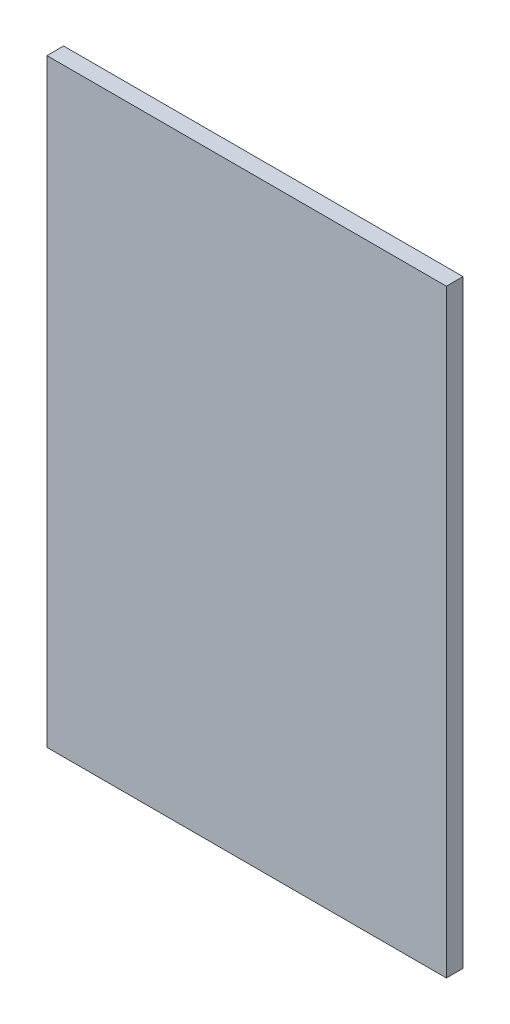
ISO-10303-21;
HEADER;
FILE_DESCRIPTION(('STEP AP214'),'2;1');
FILE_NAME('part.step','',(''),(''),'','','');
FILE_SCHEMA(('AUTOMOTIVE_DESIGN { 1 0 10303 214 1 1 1 1 }'));
ENDSEC;
DATA;
#1=APPLICATION_CONTEXT('core data for automotive mechanical design processes');
#2=APPLICATION_PROTOCOL_DEFINITION('international standard','automotive_design',2000,#1);
#3=PRODUCT_CONTEXT('',#1,'mechanical');
#4=PRODUCT('Part','Part','',(#3));
#5=PRODUCT_RELATED_PRODUCT_CATEGORY('part','',(#4));
#6=PRODUCT_DEFINITION_FORMATION('','',#4);
#7=PRODUCT_DEFINITION_CONTEXT('part definition',#1,'design');
#8=PRODUCT_DEFINITION('design','',#6,#7);
#9=PRODUCT_DEFINITION_SHAPE('','',#8);
#10=(LENGTH_UNIT() NAMED_UNIT(*) SI_UNIT(.MILLI.,.METRE.));
#11=(NAMED_UNIT(*) PLANE_ANGLE_UNIT() SI_UNIT($,.RADIAN.));
#12=(NAMED_UNIT(*) SI_UNIT($,.STERADIAN.) SOLID_ANGLE_UNIT());
#13=UNCERTAINTY_MEASURE_WITH_UNIT(LENGTH_MEASURE(1.E-05),#10,'distance_accuracy_value','');
#14=(GEOMETRIC_REPRESENTATION_CONTEXT(3) GLOBAL_UNCERTAINTY_ASSIGNED_CONTEXT((#13)) GLOBAL_UNIT_ASSIGNED_CONTEXT((#10,
#11,#12)) REPRESENTATION_CONTEXT('',''));
#15=CARTESIAN_POINT('',(0.,0.,0.));
#16=DIRECTION('',(0.,0.,1.));
#17=DIRECTION('',(1.,0.,0.));
#18=AXIS2_PLACEMENT_3D('',#15,#16,#17);
#19=CARTESIAN_POINT('',(0.,0.,0.));
#20=DIRECTION('',(0.,0.,-1.));
#21=DIRECTION('',(-1.,0.,0.));
#22=AXIS2_PLACEMENT_3D('',#19,#20,#21);
#23=PLANE('',#22);
#24=DIRECTION('',(0.,1.,0.));
#25=VECTOR('',#24,1.);
#26=CARTESIAN_POINT('',(60.,-90.,0.));
#27=LINE('',#26,#25);
#28=CARTESIAN_POINT('',(60.,-90.,0.));
#29=VERTEX_POINT('',#28);
#30=CARTESIAN_POINT('',(60.,90.,0.));
#31=VERTEX_POINT('',#30);
#32=EDGE_CURVE('E132',#29,#31,#27,.T.);
#33=ORIENTED_EDGE('',*,*,#32,.F.);
#34=DIRECTION('',(1.,0.,0.));
#35=VECTOR('',#34,1.);
#36=CARTESIAN_POINT('',(-60.,-90.,0.));
#37=LINE('',#36,#35);
#38=CARTESIAN_POINT('',(-60.,-90.,0.));
#39=VERTEX_POINT('',#38);
#40=EDGE_CURVE('E78',#39,#29,#37,.T.);
#41=ORIENTED_EDGE('',*,*,#40,.F.);
#42=DIRECTION('',(0.,-1.,0.));
#43=VECTOR('',#42,1.);
#44=CARTESIAN_POINT('',(-60.,-90.,0.));
#45=LINE('',#44,#43);
#46=CARTESIAN_POINT('',(-60.,90.,0.));
#47=VERTEX_POINT('',#46);
#48=EDGE_CURVE('E148',#47,#39,#45,.T.);
#49=ORIENTED_EDGE('',*,*,#48,.F.);
#50=DIRECTION('',(-1.,0.,0.));
#51=VECTOR('',#50,1.);
#52=CARTESIAN_POINT('',(-60.,90.,0.));
#53=LINE('',#52,#51);
#54=EDGE_CURVE('E135',#31,#47,#53,.T.);
#55=ORIENTED_EDGE('',*,*,#54,.F.);
#56=EDGE_LOOP('',(#33,#41,#49,#55));
#57=FACE_BOUND('',#56,.T.);
#58=DIRECTION('',(1.,0.,0.));
#59=VECTOR('',#58,1.);
#60=CARTESIAN_POINT('',(4.,70.,0.));
#61=LINE('',#60,#59);
#62=CARTESIAN_POINT('',(-4.,70.,0.));
#63=VERTEX_POINT('',#62);
#64=CARTESIAN_POINT('',(4.,70.,0.));
#65=VERTEX_POINT('',#64);
#66=EDGE_CURVE('E263',#63,#65,#61,.T.);
#67=ORIENTED_EDGE('',*,*,#66,.F.);
#68=DIRECTION('',(0.,1.,0.));
#69=VECTOR('',#68,1.);
#70=CARTESIAN_POINT('',(-4.,-70.,0.));
#71=LINE('',#70,#69);
#72=CARTESIAN_POINT('',(-4.,-70.,0.));
#73=VERTEX_POINT('',#72);
#74=EDGE_CURVE('E130',#73,#63,#71,.T.);
#75=ORIENTED_EDGE('',*,*,#74,.F.);
#76=DIRECTION('',(-1.,0.,0.));
#77=VECTOR('',#76,1.);
#78=CARTESIAN_POINT('',(4.,-70.,0.));
#79=LINE('',#78,#77);
#80=CARTESIAN_POINT('',(4.,-70.,0.));
#81=VERTEX_POINT('',#80);
#82=EDGE_CURVE('E126',#81,#73,#79,.T.);
#83=ORIENTED_EDGE('',*,*,#82,.F.);
#84=DIRECTION('',(0.,-1.,0.));
#85=VECTOR('',#84,1.);
#86=CARTESIAN_POINT('',(4.,-70.,0.));
#87=LINE('',#86,#85);
#88=EDGE_CURVE('E260',#65,#81,#87,.T.);
#89=ORIENTED_EDGE('',*,*,#88,.F.);
#90=EDGE_LOOP('',(#67,#75,#83,#89));
#91=FACE_BOUND('',#90,.T.);
#92=ADVANCED_FACE('F33',(#57,#91),#23,.T.);
#93=CARTESIAN_POINT('',(60.,-90.,5.));
#94=DIRECTION('',(-1.,0.,0.));
#95=DIRECTION('',(0.,0.,1.));
#96=AXIS2_PLACEMENT_3D('',#93,#94,#95);
#97=PLANE('',#96);
#98=ORIENTED_EDGE('',*,*,#32,.T.);
#99=DIRECTION('',(0.,0.,-1.));
#100=VECTOR('',#99,1.);
#101=CARTESIAN_POINT('',(60.,90.,5.));
#102=LINE('',#101,#100);
#103=CARTESIAN_POINT('',(60.,90.,5.));
#104=VERTEX_POINT('',#103);
#105=EDGE_CURVE('E11',#104,#31,#102,.T.);
#106=ORIENTED_EDGE('',*,*,#105,.F.);
#107=DIRECTION('',(0.,1.,0.));
#108=VECTOR('',#107,1.);
#109=CARTESIAN_POINT('',(60.,-90.,5.));
#110=LINE('',#109,#108);
#111=CARTESIAN_POINT('',(60.,-90.,5.));
#112=VERTEX_POINT('',#111);
#113=EDGE_CURVE('E140',#112,#104,#110,.T.);
#114=ORIENTED_EDGE('',*,*,#113,.F.);
#115=DIRECTION('',(0.,0.,-1.));
#116=VECTOR('',#115,1.);
#117=CARTESIAN_POINT('',(60.,-90.,5.));
#118=LINE('',#117,#116);
#119=EDGE_CURVE('E145',#112,#29,#118,.T.);
#120=ORIENTED_EDGE('',*,*,#119,.T.);
#121=EDGE_LOOP('',(#98,#106,#114,#120));
#122=FACE_BOUND('',#121,.T.);
#123=ADVANCED_FACE('F35',(#122),#97,.F.);
#124=CARTESIAN_POINT('',(-60.,90.,5.));
#125=DIRECTION('',(0.,-1.,0.));
#126=DIRECTION('',(0.,0.,-1.));
#127=AXIS2_PLACEMENT_3D('',#124,#125,#126);
#128=PLANE('',#127);
#129=ORIENTED_EDGE('',*,*,#54,.T.);
#130=DIRECTION('',(0.,0.,-1.));
#131=VECTOR('',#130,1.);
#132=CARTESIAN_POINT('',(-60.,90.,5.));
#133=LINE('',#132,#131);
#134=CARTESIAN_POINT('',(-60.,90.,5.));
#135=VERTEX_POINT('',#134);
#136=EDGE_CURVE('E41',#135,#47,#133,.T.);
#137=ORIENTED_EDGE('',*,*,#136,.F.);
#138=DIRECTION('',(-1.,0.,0.));
#139=VECTOR('',#138,1.);
#140=CARTESIAN_POINT('',(-60.,90.,5.));
#141=LINE('',#140,#139);
#142=EDGE_CURVE('E85',#104,#135,#141,.T.);
#143=ORIENTED_EDGE('',*,*,#142,.F.);
#144=ORIENTED_EDGE('',*,*,#105,.T.);
#145=EDGE_LOOP('',(#129,#137,#143,#144));
#146=FACE_BOUND('',#145,.T.);
#147=ADVANCED_FACE('F174',(#146),#128,.F.);
#148=CARTESIAN_POINT('',(-60.,-90.,5.));
#149=DIRECTION('',(1.,0.,0.));
#150=DIRECTION('',(0.,0.,-1.));
#151=AXIS2_PLACEMENT_3D('',#148,#149,#150);
#152=PLANE('',#151);
#153=ORIENTED_EDGE('',*,*,#48,.T.);
#154=DIRECTION('',(0.,0.,-1.));
#155=VECTOR('',#154,1.);
#156=CARTESIAN_POINT('',(-60.,-90.,5.));
#157=LINE('',#156,#155);
#158=CARTESIAN_POINT('',(-60.,-90.,5.));
#159=VERTEX_POINT('',#158);
#160=EDGE_CURVE('E152',#159,#39,#157,.T.);
#161=ORIENTED_EDGE('',*,*,#160,.F.);
#162=DIRECTION('',(0.,-1.,0.));
#163=VECTOR('',#162,1.);
#164=CARTESIAN_POINT('',(-60.,-90.,5.));
#165=LINE('',#164,#163);
#166=EDGE_CURVE('E143',#135,#159,#165,.T.);
#167=ORIENTED_EDGE('',*,*,#166,.F.);
#168=ORIENTED_EDGE('',*,*,#136,.T.);
#169=EDGE_LOOP('',(#153,#161,#167,#168));
#170=FACE_BOUND('',#169,.T.);
#171=ADVANCED_FACE('F157',(#170),#152,.F.);
#172=CARTESIAN_POINT('',(-60.,-90.,5.));
#173=DIRECTION('',(0.,1.,0.));
#174=DIRECTION('',(0.,0.,1.));
#175=AXIS2_PLACEMENT_3D('',#172,#173,#174);
#176=PLANE('',#175);
#177=ORIENTED_EDGE('',*,*,#40,.T.);
#178=ORIENTED_EDGE('',*,*,#119,.F.);
#179=DIRECTION('',(1.,0.,0.));
#180=VECTOR('',#179,1.);
#181=CARTESIAN_POINT('',(-60.,-90.,5.));
#182=LINE('',#181,#180);
#183=EDGE_CURVE('E57',#159,#112,#182,.T.);
#184=ORIENTED_EDGE('',*,*,#183,.F.);
#185=ORIENTED_EDGE('',*,*,#160,.T.);
#186=EDGE_LOOP('',(#177,#178,#184,#185));
#187=FACE_BOUND('',#186,.T.);
#188=ADVANCED_FACE('F165',(#187),#176,.F.);
#189=CARTESIAN_POINT('',(0.,0.,5.));
#190=DIRECTION('',(0.,0.,-1.));
#191=DIRECTION('',(-1.,0.,0.));
#192=AXIS2_PLACEMENT_3D('',#189,#190,#191);
#193=PLANE('',#192);
#194=ORIENTED_EDGE('',*,*,#113,.T.);
#195=ORIENTED_EDGE('',*,*,#142,.T.);
#196=ORIENTED_EDGE('',*,*,#166,.T.);
#197=ORIENTED_EDGE('',*,*,#183,.T.);
#198=EDGE_LOOP('',(#194,#195,#196,#197));
#199=FACE_BOUND('',#198,.T.);
#200=ADVANCED_FACE('F167',(#199),#193,.F.);
#201=CARTESIAN_POINT('',(-4.,-70.,-14.));
#202=DIRECTION('',(1.,0.,0.));
#203=DIRECTION('',(0.,0.,-1.));
#204=AXIS2_PLACEMENT_3D('',#201,#202,#203);
#205=PLANE('',#204);
#206=ORIENTED_EDGE('',*,*,#74,.T.);
#207=DIRECTION('',(0.,0.,1.));
#208=VECTOR('',#207,1.);
#209=CARTESIAN_POINT('',(-4.,70.,-14.));
#210=LINE('',#209,#208);
#211=CARTESIAN_POINT('',(-4.,70.,-14.));
#212=VERTEX_POINT('',#211);
#213=EDGE_CURVE('E111',#212,#63,#210,.T.);
#214=ORIENTED_EDGE('',*,*,#213,.F.);
#215=DIRECTION('',(0.,1.,0.));
#216=VECTOR('',#215,1.);
#217=CARTESIAN_POINT('',(-4.,-70.,-14.));
#218=LINE('',#217,#216);
#219=CARTESIAN_POINT('',(-4.,-70.,-14.));
#220=VERTEX_POINT('',#219);
#221=EDGE_CURVE('E118',#220,#212,#218,.T.);
#222=ORIENTED_EDGE('',*,*,#221,.F.);
#223=DIRECTION('',(0.,0.,1.));
#224=VECTOR('',#223,1.);
#225=CARTESIAN_POINT('',(-4.,-70.,-14.));
#226=LINE('',#225,#224);
#227=EDGE_CURVE('E258',#220,#73,#226,.T.);
#228=ORIENTED_EDGE('',*,*,#227,.T.);
#229=EDGE_LOOP('',(#206,#214,#222,#228));
#230=FACE_BOUND('',#229,.T.);
#231=ADVANCED_FACE('F128',(#230),#205,.F.);
#232=CARTESIAN_POINT('',(4.,70.,-14.));
#233=DIRECTION('',(0.,-1.,0.));
#234=DIRECTION('',(0.,0.,-1.));
#235=AXIS2_PLACEMENT_3D('',#232,#233,#234);
#236=PLANE('',#235);
#237=ORIENTED_EDGE('',*,*,#66,.T.);
#238=DIRECTION('',(0.,0.,1.));
#239=VECTOR('',#238,1.);
#240=CARTESIAN_POINT('',(4.,70.,-14.));
#241=LINE('',#240,#239);
#242=CARTESIAN_POINT('',(4.,70.,-14.));
#243=VERTEX_POINT('',#242);
#244=EDGE_CURVE('E114',#243,#65,#241,.T.);
#245=ORIENTED_EDGE('',*,*,#244,.F.);
#246=DIRECTION('',(1.,0.,0.));
#247=VECTOR('',#246,1.);
#248=CARTESIAN_POINT('',(4.,70.,-14.));
#249=LINE('',#248,#247);
#250=EDGE_CURVE('E107',#212,#243,#249,.T.);
#251=ORIENTED_EDGE('',*,*,#250,.F.);
#252=ORIENTED_EDGE('',*,*,#213,.T.);
#253=EDGE_LOOP('',(#237,#245,#251,#252));
#254=FACE_BOUND('',#253,.T.);
#255=ADVANCED_FACE('F109',(#254),#236,.F.);
#256=CARTESIAN_POINT('',(4.,-70.,-14.));
#257=DIRECTION('',(-1.,0.,0.));
#258=DIRECTION('',(0.,0.,1.));
#259=AXIS2_PLACEMENT_3D('',#256,#257,#258);
#260=PLANE('',#259);
#261=ORIENTED_EDGE('',*,*,#88,.T.);
#262=DIRECTION('',(0.,0.,1.));
#263=VECTOR('',#262,1.);
#264=CARTESIAN_POINT('',(4.,-70.,-14.));
#265=LINE('',#264,#263);
#266=CARTESIAN_POINT('',(4.,-70.,-14.));
#267=VERTEX_POINT('',#266);
#268=EDGE_CURVE('E48',#267,#81,#265,.T.);
#269=ORIENTED_EDGE('',*,*,#268,.F.);
#270=DIRECTION('',(0.,-1.,0.));
#271=VECTOR('',#270,1.);
#272=CARTESIAN_POINT('',(4.,-70.,-14.));
#273=LINE('',#272,#271);
#274=EDGE_CURVE('E117',#243,#267,#273,.T.);
#275=ORIENTED_EDGE('',*,*,#274,.F.);
#276=ORIENTED_EDGE('',*,*,#244,.T.);
#277=EDGE_LOOP('',(#261,#269,#275,#276));
#278=FACE_BOUND('',#277,.T.);
#279=ADVANCED_FACE('F186',(#278),#260,.F.);
#280=CARTESIAN_POINT('',(4.,-70.,-14.));
#281=DIRECTION('',(0.,1.,0.));
#282=DIRECTION('',(0.,0.,1.));
#283=AXIS2_PLACEMENT_3D('',#280,#281,#282);
#284=PLANE('',#283);
#285=ORIENTED_EDGE('',*,*,#82,.T.);
#286=ORIENTED_EDGE('',*,*,#227,.F.);
#287=DIRECTION('',(-1.,0.,0.));
#288=VECTOR('',#287,1.);
#289=CARTESIAN_POINT('',(4.,-70.,-14.));
#290=LINE('',#289,#288);
#291=EDGE_CURVE('E122',#267,#220,#290,.T.);
#292=ORIENTED_EDGE('',*,*,#291,.F.);
#293=ORIENTED_EDGE('',*,*,#268,.T.);
#294=EDGE_LOOP('',(#285,#286,#292,#293));
#295=FACE_BOUND('',#294,.T.);
#296=ADVANCED_FACE('F189',(#295),#284,.F.);
#297=CARTESIAN_POINT('',(0.,0.,-14.));
#298=DIRECTION('',(0.,0.,1.));
#299=DIRECTION('',(1.,0.,0.));
#300=AXIS2_PLACEMENT_3D('',#297,#298,#299);
#301=PLANE('',#300);
#302=ORIENTED_EDGE('',*,*,#221,.T.);
#303=ORIENTED_EDGE('',*,*,#250,.T.);
#304=ORIENTED_EDGE('',*,*,#274,.T.);
#305=ORIENTED_EDGE('',*,*,#291,.T.);
#306=EDGE_LOOP('',(#302,#303,#304,#305));
#307=FACE_BOUND('',#306,.T.);
#308=ADVANCED_FACE('F121',(#307),#301,.F.);
#309=CLOSED_SHELL('',(#92,#123,#147,#171,#188,#200,#231,#255,#279,#296,#308));
#310=MANIFOLD_SOLID_BREP('B2',#309);
#311=ADVANCED_BREP_SHAPE_REPRESENTATION('',(#18,#310),#14);
#312=SHAPE_DEFINITION_REPRESENTATION(#9,#311);
ENDSEC;
END-ISO-10303-21;
